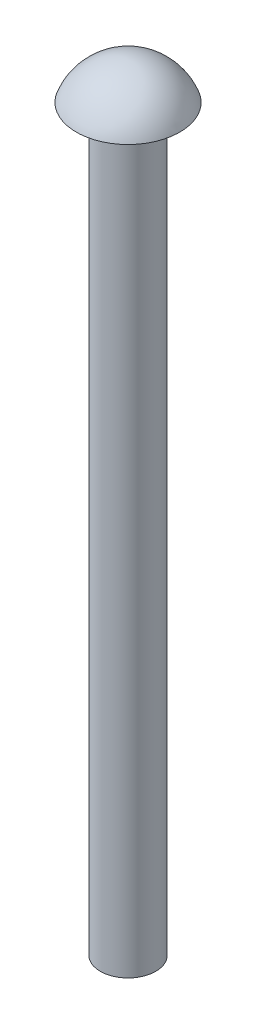
ISO-10303-21;
HEADER;
FILE_DESCRIPTION(('STEP AP214'),'2;1');
FILE_NAME('part.step','',(''),(''),'','','');
FILE_SCHEMA(('AUTOMOTIVE_DESIGN { 1 0 10303 214 1 1 1 1 }'));
ENDSEC;
DATA;
#1=APPLICATION_CONTEXT('core data for automotive mechanical design processes');
#2=APPLICATION_PROTOCOL_DEFINITION('international standard','automotive_design',2000,#1);
#3=PRODUCT_CONTEXT('',#1,'mechanical');
#4=PRODUCT('Part','Part','',(#3));
#5=PRODUCT_RELATED_PRODUCT_CATEGORY('part','',(#4));
#6=PRODUCT_DEFINITION_FORMATION('','',#4);
#7=PRODUCT_DEFINITION_CONTEXT('part definition',#1,'design');
#8=PRODUCT_DEFINITION('design','',#6,#7);
#9=PRODUCT_DEFINITION_SHAPE('','',#8);
#10=(LENGTH_UNIT() NAMED_UNIT(*) SI_UNIT(.MILLI.,.METRE.));
#11=(NAMED_UNIT(*) PLANE_ANGLE_UNIT() SI_UNIT($,.RADIAN.));
#12=(NAMED_UNIT(*) SI_UNIT($,.STERADIAN.) SOLID_ANGLE_UNIT());
#13=UNCERTAINTY_MEASURE_WITH_UNIT(LENGTH_MEASURE(1.E-05),#10,'distance_accuracy_value','');
#14=(GEOMETRIC_REPRESENTATION_CONTEXT(3) GLOBAL_UNCERTAINTY_ASSIGNED_CONTEXT((#13)) GLOBAL_UNIT_ASSIGNED_CONTEXT((#10,
#11,#12)) REPRESENTATION_CONTEXT('',''));
#15=CARTESIAN_POINT('',(0.,0.,0.));
#16=DIRECTION('',(0.,0.,1.));
#17=DIRECTION('',(1.,0.,0.));
#18=AXIS2_PLACEMENT_3D('',#15,#16,#17);
#19=CARTESIAN_POINT('',(2.8,-1.03349091005191,0.0524935071799281));
#20=DIRECTION('',(-1.,0.,0.));
#21=DIRECTION('',(0.,0.,-1.));
#22=AXIS2_PLACEMENT_3D('',#19,#20,#21);
#23=CIRCLE('',#22,3.03394506701483);
#24=TRIMMED_CURVE('',#23,(PARAMETER_VALUE(-1.55349340091415)),
(PARAMETER_VALUE(1.55349340091415)),.T.,.PARAMETER.);
#25=CARTESIAN_POINT('',(2.8,-1.03349091005191,0.));
#26=DIRECTION('',(0.,-1.,0.));
#27=AXIS1_PLACEMENT('',#25,#26);
#28=SURFACE_OF_REVOLUTION('',#24,#27);
#29=CARTESIAN_POINT('',(2.8,0.,0.));
#30=DIRECTION('',(0.,-1.,0.));
#31=DIRECTION('',(0.,0.,-1.));
#32=AXIS2_PLACEMENT_3D('',#29,#30,#31);
#33=CIRCLE('',#32,2.8);
#34=CARTESIAN_POINT('',(2.8,0.,-2.8));
#35=VERTEX_POINT('',#34);
#36=EDGE_CURVE('E11',#35,#35,#33,.T.);
#37=ORIENTED_EDGE('',*,*,#36,.F.);
#38=EDGE_LOOP('',(#37));
#39=FACE_BOUND('',#38,.T.);
#40=CARTESIAN_POINT('',(2.8,1.99999999999999,0.));
#41=VERTEX_POINT('',#40);
#42=VERTEX_LOOP('',#41);
#43=FACE_BOUND('',#42,.T.);
#44=ADVANCED_FACE('F41',(#39,#43),#28,.T.);
#45=CARTESIAN_POINT('',(0.,0.,0.));
#46=DIRECTION('',(0.,1.,0.));
#47=DIRECTION('',(0.,0.,1.));
#48=AXIS2_PLACEMENT_3D('',#45,#46,#47);
#49=PLANE('',#48);
#50=CARTESIAN_POINT('',(2.8,0.,0.));
#51=DIRECTION('',(0.,-1.,0.));
#52=DIRECTION('',(0.,0.,-1.));
#53=AXIS2_PLACEMENT_3D('',#50,#51,#52);
#54=CIRCLE('',#53,1.5);
#55=CARTESIAN_POINT('',(2.8,0.,-1.5));
#56=VERTEX_POINT('',#55);
#57=EDGE_CURVE('E48',#56,#56,#54,.T.);
#58=ORIENTED_EDGE('',*,*,#57,.F.);
#59=EDGE_LOOP('',(#58));
#60=FACE_BOUND('',#59,.T.);
#61=ORIENTED_EDGE('',*,*,#36,.T.);
#62=EDGE_LOOP('',(#61));
#63=FACE_BOUND('',#62,.T.);
#64=ADVANCED_FACE('F52',(#60,#63),#49,.F.);
#65=CARTESIAN_POINT('',(2.8,-40.,0.));
#66=DIRECTION('',(0.,-1.,0.));
#67=DIRECTION('',(0.,0.,-1.));
#68=AXIS2_PLACEMENT_3D('',#65,#66,#67);
#69=CYLINDRICAL_SURFACE('',#68,1.5);
#70=CARTESIAN_POINT('',(2.8,-40.,0.));
#71=DIRECTION('',(0.,-1.,0.));
#72=DIRECTION('',(0.,0.,-1.));
#73=AXIS2_PLACEMENT_3D('',#70,#71,#72);
#74=CIRCLE('',#73,1.5);
#75=CARTESIAN_POINT('',(2.8,-40.,-1.5));
#76=VERTEX_POINT('',#75);
#77=EDGE_CURVE('E75',#76,#76,#74,.T.);
#78=ORIENTED_EDGE('',*,*,#77,.F.);
#79=EDGE_LOOP('',(#78));
#80=FACE_BOUND('',#79,.T.);
#81=ORIENTED_EDGE('',*,*,#57,.T.);
#82=EDGE_LOOP('',(#81));
#83=FACE_BOUND('',#82,.T.);
#84=ADVANCED_FACE('F57',(#80,#83),#69,.T.);
#85=CARTESIAN_POINT('',(1.3,-40.,0.));
#86=DIRECTION('',(0.,1.,0.));
#87=DIRECTION('',(0.,0.,1.));
#88=AXIS2_PLACEMENT_3D('',#85,#86,#87);
#89=PLANE('',#88);
#90=ORIENTED_EDGE('',*,*,#77,.T.);
#91=EDGE_LOOP('',(#90));
#92=FACE_BOUND('',#91,.T.);
#93=ADVANCED_FACE('F64',(#92),#89,.F.);
#94=CLOSED_SHELL('',(#44,#64,#84,#93));
#95=MANIFOLD_SOLID_BREP('B2',#94);
#96=ADVANCED_BREP_SHAPE_REPRESENTATION('',(#18,#95),#14);
#97=SHAPE_DEFINITION_REPRESENTATION(#9,#96);
ENDSEC;
END-ISO-10303-21;
